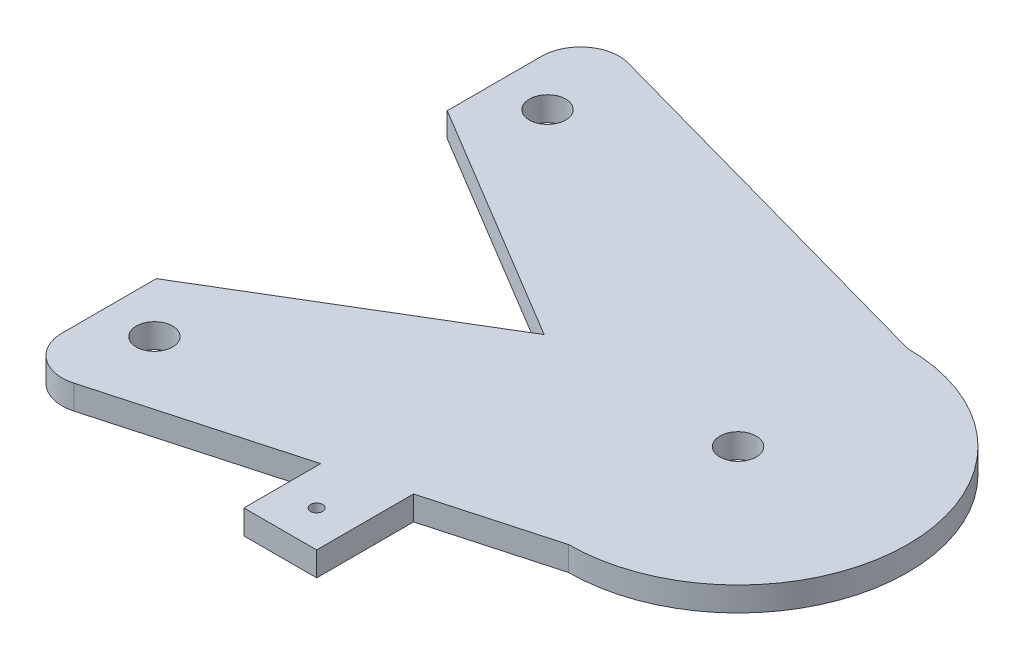
ISO-10303-21;
HEADER;
FILE_DESCRIPTION(('STEP AP214'),'2;1');
FILE_NAME('part.step','',(''),(''),'','','');
FILE_SCHEMA(('AUTOMOTIVE_DESIGN { 1 0 10303 214 1 1 1 1 }'));
ENDSEC;
DATA;
#1=APPLICATION_CONTEXT('core data for automotive mechanical design processes');
#2=APPLICATION_PROTOCOL_DEFINITION('international standard','automotive_design',2000,#1);
#3=PRODUCT_CONTEXT('',#1,'mechanical');
#4=PRODUCT('Part','Part','',(#3));
#5=PRODUCT_RELATED_PRODUCT_CATEGORY('part','',(#4));
#6=PRODUCT_DEFINITION_FORMATION('','',#4);
#7=PRODUCT_DEFINITION_CONTEXT('part definition',#1,'design');
#8=PRODUCT_DEFINITION('design','',#6,#7);
#9=PRODUCT_DEFINITION_SHAPE('','',#8);
#10=(LENGTH_UNIT() NAMED_UNIT(*) SI_UNIT(.MILLI.,.METRE.));
#11=(NAMED_UNIT(*) PLANE_ANGLE_UNIT() SI_UNIT($,.RADIAN.));
#12=(NAMED_UNIT(*) SI_UNIT($,.STERADIAN.) SOLID_ANGLE_UNIT());
#13=UNCERTAINTY_MEASURE_WITH_UNIT(LENGTH_MEASURE(1.E-05),#10,'distance_accuracy_value','');
#14=(GEOMETRIC_REPRESENTATION_CONTEXT(3) GLOBAL_UNCERTAINTY_ASSIGNED_CONTEXT((#13)) GLOBAL_UNIT_ASSIGNED_CONTEXT((#10,
#11,#12)) REPRESENTATION_CONTEXT('',''));
#15=CARTESIAN_POINT('',(0.,0.,0.));
#16=DIRECTION('',(0.,0.,1.));
#17=DIRECTION('',(1.,0.,0.));
#18=AXIS2_PLACEMENT_3D('',#15,#16,#17);
#19=CARTESIAN_POINT('',(50.8,6.35,0.));
#20=DIRECTION('',(0.,-1.,0.));
#21=DIRECTION('',(0.,0.,-1.));
#22=AXIS2_PLACEMENT_3D('',#19,#20,#21);
#23=PLANE('',#22);
#24=CARTESIAN_POINT('',(50.8,6.35,0.));
#25=DIRECTION('',(0.,1.,0.));
#26=DIRECTION('',(0.,0.,-1.));
#27=AXIS2_PLACEMENT_3D('',#24,#25,#26);
#28=CIRCLE('',#27,44.45);
#29=CARTESIAN_POINT('',(50.8,6.35,44.45));
#30=VERTEX_POINT('',#29);
#31=CARTESIAN_POINT('',(50.8,6.35,-44.45));
#32=VERTEX_POINT('',#31);
#33=EDGE_CURVE('E191',#30,#32,#28,.T.);
#34=ORIENTED_EDGE('',*,*,#33,.T.);
#35=DIRECTION('',(-0.96351790962994,0.,-0.267643863786095));
#36=VECTOR('',#35,1.);
#37=CARTESIAN_POINT('',(-50.6207383439333,6.35,-72.6224273177592));
#38=LINE('',#37,#36);
#39=CARTESIAN_POINT('',(-50.6207383439333,6.35,-72.6224273177592));
#40=VERTEX_POINT('',#39);
#41=EDGE_CURVE('E114',#32,#40,#38,.T.);
#42=ORIENTED_EDGE('',*,*,#41,.T.);
#43=CARTESIAN_POINT('',(-53.34,6.35,-62.8330853559191));
#44=DIRECTION('',(0.,1.,0.));
#45=DIRECTION('',(0.,0.,1.));
#46=AXIS2_PLACEMENT_3D('',#43,#44,#45);
#47=CIRCLE('',#46,10.16);
#48=CARTESIAN_POINT('',(-63.5,6.35,-62.8330853559191));
#49=VERTEX_POINT('',#48);
#50=EDGE_CURVE('E221',#40,#49,#47,.T.);
#51=ORIENTED_EDGE('',*,*,#50,.T.);
#52=DIRECTION('',(0.,0.,1.));
#53=VECTOR('',#52,1.);
#54=CARTESIAN_POINT('',(-63.5,6.35,-62.8330853559191));
#55=LINE('',#54,#53);
#56=CARTESIAN_POINT('',(-63.5,6.35,-38.1));
#57=VERTEX_POINT('',#56);
#58=EDGE_CURVE('E240',#49,#57,#55,.T.);
#59=ORIENTED_EDGE('',*,*,#58,.T.);
#60=DIRECTION('',(0.857492925712544,0.,0.514495755427527));
#61=VECTOR('',#60,1.);
#62=CARTESIAN_POINT('',(-63.5,6.35,-38.1));
#63=LINE('',#62,#61);
#64=CARTESIAN_POINT('',(0.,6.35,0.));
#65=VERTEX_POINT('',#64);
#66=EDGE_CURVE('E237',#57,#65,#63,.T.);
#67=ORIENTED_EDGE('',*,*,#66,.T.);
#68=DIRECTION('',(-0.857492925712544,0.,0.514495755427527));
#69=VECTOR('',#68,1.);
#70=CARTESIAN_POINT('',(0.,6.35,0.));
#71=LINE('',#70,#69);
#72=CARTESIAN_POINT('',(-63.5,6.35,38.1));
#73=VERTEX_POINT('',#72);
#74=EDGE_CURVE('E239',#65,#73,#71,.T.);
#75=ORIENTED_EDGE('',*,*,#74,.T.);
#76=DIRECTION('',(0.,0.,1.));
#77=VECTOR('',#76,1.);
#78=CARTESIAN_POINT('',(-63.5,6.35,38.1));
#79=LINE('',#78,#77);
#80=CARTESIAN_POINT('',(-63.5,6.35,62.8330853559191));
#81=VERTEX_POINT('',#80);
#82=EDGE_CURVE('E242',#73,#81,#79,.T.);
#83=ORIENTED_EDGE('',*,*,#82,.T.);
#84=CARTESIAN_POINT('',(-53.34,6.35,62.8330853559191));
#85=DIRECTION('',(0.,1.,0.));
#86=DIRECTION('',(0.,0.,1.));
#87=AXIS2_PLACEMENT_3D('',#84,#85,#86);
#88=CIRCLE('',#87,10.16);
#89=CARTESIAN_POINT('',(-50.6207383439332,6.35,72.6224273177592));
#90=VERTEX_POINT('',#89);
#91=EDGE_CURVE('E248',#81,#90,#88,.T.);
#92=ORIENTED_EDGE('',*,*,#91,.T.);
#93=DIRECTION('',(0.963517909629941,0.,-0.267643863786095));
#94=VECTOR('',#93,1.);
#95=CARTESIAN_POINT('',(-50.6207383439332,6.35,72.6224273177592));
#96=LINE('',#95,#94);
#97=CARTESIAN_POINT('',(0.,6.35,58.5611111111111));
#98=VERTEX_POINT('',#97);
#99=EDGE_CURVE('E250',#90,#98,#96,.T.);
#100=ORIENTED_EDGE('',*,*,#99,.T.);
#101=DIRECTION('',(0.,0.,1.));
#102=VECTOR('',#101,1.);
#103=CARTESIAN_POINT('',(0.,6.35,58.5611111111111));
#104=LINE('',#103,#102);
#105=CARTESIAN_POINT('',(0.,6.35,78.6694444444445));
#106=VERTEX_POINT('',#105);
#107=EDGE_CURVE('E148',#98,#106,#104,.T.);
#108=ORIENTED_EDGE('',*,*,#107,.T.);
#109=DIRECTION('',(1.,0.,0.));
#110=VECTOR('',#109,1.);
#111=CARTESIAN_POINT('',(0.,6.35,78.6694444444445));
#112=LINE('',#111,#110);
#113=CARTESIAN_POINT('',(19.05,6.35,78.6694444444445));
#114=VERTEX_POINT('',#113);
#115=EDGE_CURVE('E142',#106,#114,#112,.T.);
#116=ORIENTED_EDGE('',*,*,#115,.T.);
#117=DIRECTION('',(0.,0.,-1.));
#118=VECTOR('',#117,1.);
#119=CARTESIAN_POINT('',(19.05,6.35,78.6694444444445));
#120=LINE('',#119,#118);
#121=CARTESIAN_POINT('',(19.05,6.35,53.2694444444444));
#122=VERTEX_POINT('',#121);
#123=EDGE_CURVE('E146',#114,#122,#120,.T.);
#124=ORIENTED_EDGE('',*,*,#123,.T.);
#125=DIRECTION('',(0.963517909629941,0.,-0.267643863786095));
#126=VECTOR('',#125,1.);
#127=CARTESIAN_POINT('',(50.8,6.35,44.45));
#128=LINE('',#127,#126);
#129=EDGE_CURVE('E56',#122,#30,#128,.T.);
#130=ORIENTED_EDGE('',*,*,#129,.T.);
#131=EDGE_LOOP('',(#34,#42,#51,#59,#67,#75,#83,#92,#100,#108,#116,#124,#130));
#132=FACE_BOUND('',#131,.T.);
#133=CARTESIAN_POINT('',(50.8,6.35,0.));
#134=DIRECTION('',(0.,1.,0.));
#135=DIRECTION('',(0.,0.,1.));
#136=AXIS2_PLACEMENT_3D('',#133,#134,#135);
#137=CIRCLE('',#136,4.7625);
#138=CARTESIAN_POINT('',(50.8,6.35,4.7625));
#139=VERTEX_POINT('',#138);
#140=EDGE_CURVE('E170',#139,#139,#137,.T.);
#141=ORIENTED_EDGE('',*,*,#140,.F.);
#142=EDGE_LOOP('',(#141));
#143=FACE_BOUND('',#142,.T.);
#144=CARTESIAN_POINT('',(-50.6207383439333,6.35,-51.4974351620596));
#145=DIRECTION('',(0.,1.,0.));
#146=DIRECTION('',(0.,0.,1.));
#147=AXIS2_PLACEMENT_3D('',#144,#145,#146);
#148=CIRCLE('',#147,4.7625);
#149=CARTESIAN_POINT('',(-50.6207383439333,6.35,-46.7349351620596));
#150=VERTEX_POINT('',#149);
#151=EDGE_CURVE('E314',#150,#150,#148,.T.);
#152=ORIENTED_EDGE('',*,*,#151,.F.);
#153=EDGE_LOOP('',(#152));
#154=FACE_BOUND('',#153,.T.);
#155=CARTESIAN_POINT('',(-50.6207383439333,6.35,51.4974351620596));
#156=DIRECTION('',(0.,1.,0.));
#157=DIRECTION('',(0.,0.,1.));
#158=AXIS2_PLACEMENT_3D('',#155,#156,#157);
#159=CIRCLE('',#158,4.7625);
#160=CARTESIAN_POINT('',(-50.6207383439333,6.35,56.2599351620596));
#161=VERTEX_POINT('',#160);
#162=EDGE_CURVE('E308',#161,#161,#159,.T.);
#163=ORIENTED_EDGE('',*,*,#162,.F.);
#164=EDGE_LOOP('',(#163));
#165=FACE_BOUND('',#164,.T.);
#166=CARTESIAN_POINT('',(9.525,6.35,69.1444444444444));
#167=DIRECTION('',(0.,1.,0.));
#168=DIRECTION('',(0.,0.,1.));
#169=AXIS2_PLACEMENT_3D('',#166,#167,#168);
#170=CIRCLE('',#169,1.5875);
#171=CARTESIAN_POINT('',(9.525,6.35,70.7319444444445));
#172=VERTEX_POINT('',#171);
#173=EDGE_CURVE('E299',#172,#172,#170,.T.);
#174=ORIENTED_EDGE('',*,*,#173,.F.);
#175=EDGE_LOOP('',(#174));
#176=FACE_BOUND('',#175,.T.);
#177=ADVANCED_FACE('F39',(#132,#143,#154,#165,#176),#23,.F.);
#178=CARTESIAN_POINT('',(50.8,0.,0.));
#179=DIRECTION('',(0.,-1.,0.));
#180=DIRECTION('',(0.,0.,-1.));
#181=AXIS2_PLACEMENT_3D('',#178,#179,#180);
#182=PLANE('',#181);
#183=CARTESIAN_POINT('',(-50.6207383439333,0.,51.4974351620596));
#184=DIRECTION('',(0.,1.,0.));
#185=DIRECTION('',(0.,0.,1.));
#186=AXIS2_PLACEMENT_3D('',#183,#184,#185);
#187=CIRCLE('',#186,4.7625);
#188=CARTESIAN_POINT('',(-50.6207383439333,0.,56.2599351620596));
#189=VERTEX_POINT('',#188);
#190=EDGE_CURVE('E305',#189,#189,#187,.T.);
#191=ORIENTED_EDGE('',*,*,#190,.T.);
#192=EDGE_LOOP('',(#191));
#193=FACE_BOUND('',#192,.T.);
#194=CARTESIAN_POINT('',(50.8,0.,0.));
#195=DIRECTION('',(0.,1.,0.));
#196=DIRECTION('',(0.,0.,1.));
#197=AXIS2_PLACEMENT_3D('',#194,#195,#196);
#198=CIRCLE('',#197,4.7625);
#199=CARTESIAN_POINT('',(50.8,0.,4.7625));
#200=VERTEX_POINT('',#199);
#201=EDGE_CURVE('E317',#200,#200,#198,.T.);
#202=ORIENTED_EDGE('',*,*,#201,.T.);
#203=EDGE_LOOP('',(#202));
#204=FACE_BOUND('',#203,.T.);
#205=CARTESIAN_POINT('',(50.8,0.,0.));
#206=DIRECTION('',(0.,1.,0.));
#207=DIRECTION('',(0.,0.,-1.));
#208=AXIS2_PLACEMENT_3D('',#205,#206,#207);
#209=CIRCLE('',#208,44.45);
#210=CARTESIAN_POINT('',(50.8,0.,44.45));
#211=VERTEX_POINT('',#210);
#212=CARTESIAN_POINT('',(50.8,0.,-44.45));
#213=VERTEX_POINT('',#212);
#214=EDGE_CURVE('E166',#211,#213,#209,.T.);
#215=ORIENTED_EDGE('',*,*,#214,.F.);
#216=DIRECTION('',(0.963517909629941,0.,-0.267643863786095));
#217=VECTOR('',#216,1.);
#218=CARTESIAN_POINT('',(50.8,0.,44.45));
#219=LINE('',#218,#217);
#220=CARTESIAN_POINT('',(19.05,0.,53.2694444444444));
#221=VERTEX_POINT('',#220);
#222=EDGE_CURVE('E106',#221,#211,#219,.T.);
#223=ORIENTED_EDGE('',*,*,#222,.F.);
#224=DIRECTION('',(0.,0.,-1.));
#225=VECTOR('',#224,1.);
#226=CARTESIAN_POINT('',(19.05,0.,78.6694444444445));
#227=LINE('',#226,#225);
#228=CARTESIAN_POINT('',(19.05,0.,78.6694444444445));
#229=VERTEX_POINT('',#228);
#230=EDGE_CURVE('E100',#229,#221,#227,.T.);
#231=ORIENTED_EDGE('',*,*,#230,.F.);
#232=DIRECTION('',(1.,0.,0.));
#233=VECTOR('',#232,1.);
#234=CARTESIAN_POINT('',(0.,0.,78.6694444444445));
#235=LINE('',#234,#233);
#236=CARTESIAN_POINT('',(0.,0.,78.6694444444445));
#237=VERTEX_POINT('',#236);
#238=EDGE_CURVE('E156',#237,#229,#235,.T.);
#239=ORIENTED_EDGE('',*,*,#238,.F.);
#240=DIRECTION('',(0.,0.,1.));
#241=VECTOR('',#240,1.);
#242=CARTESIAN_POINT('',(0.,0.,58.5611111111111));
#243=LINE('',#242,#241);
#244=CARTESIAN_POINT('',(0.,0.,58.5611111111111));
#245=VERTEX_POINT('',#244);
#246=EDGE_CURVE('E186',#245,#237,#243,.T.);
#247=ORIENTED_EDGE('',*,*,#246,.F.);
#248=DIRECTION('',(0.963517909629941,0.,-0.267643863786095));
#249=VECTOR('',#248,1.);
#250=CARTESIAN_POINT('',(-50.6207383439332,0.,72.6224273177592));
#251=LINE('',#250,#249);
#252=CARTESIAN_POINT('',(-50.6207383439332,0.,72.6224273177592));
#253=VERTEX_POINT('',#252);
#254=EDGE_CURVE('E184',#253,#245,#251,.T.);
#255=ORIENTED_EDGE('',*,*,#254,.F.);
#256=CARTESIAN_POINT('',(-53.34,0.,62.8330853559191));
#257=DIRECTION('',(0.,1.,0.));
#258=DIRECTION('',(0.,0.,1.));
#259=AXIS2_PLACEMENT_3D('',#256,#257,#258);
#260=CIRCLE('',#259,10.16);
#261=CARTESIAN_POINT('',(-63.5,0.,62.8330853559191));
#262=VERTEX_POINT('',#261);
#263=EDGE_CURVE('E182',#262,#253,#260,.T.);
#264=ORIENTED_EDGE('',*,*,#263,.F.);
#265=DIRECTION('',(0.,0.,1.));
#266=VECTOR('',#265,1.);
#267=CARTESIAN_POINT('',(-63.5,0.,38.1));
#268=LINE('',#267,#266);
#269=CARTESIAN_POINT('',(-63.5,0.,38.1));
#270=VERTEX_POINT('',#269);
#271=EDGE_CURVE('E180',#270,#262,#268,.T.);
#272=ORIENTED_EDGE('',*,*,#271,.F.);
#273=DIRECTION('',(-0.857492925712544,0.,0.514495755427527));
#274=VECTOR('',#273,1.);
#275=CARTESIAN_POINT('',(0.,0.,0.));
#276=LINE('',#275,#274);
#277=CARTESIAN_POINT('',(0.,0.,0.));
#278=VERTEX_POINT('',#277);
#279=EDGE_CURVE('E178',#278,#270,#276,.T.);
#280=ORIENTED_EDGE('',*,*,#279,.F.);
#281=DIRECTION('',(0.857492925712544,0.,0.514495755427527));
#282=VECTOR('',#281,1.);
#283=CARTESIAN_POINT('',(-63.5,0.,-38.1));
#284=LINE('',#283,#282);
#285=CARTESIAN_POINT('',(-63.5,0.,-38.1));
#286=VERTEX_POINT('',#285);
#287=EDGE_CURVE('E176',#286,#278,#284,.T.);
#288=ORIENTED_EDGE('',*,*,#287,.F.);
#289=DIRECTION('',(0.,0.,1.));
#290=VECTOR('',#289,1.);
#291=CARTESIAN_POINT('',(-63.5,0.,-62.8330853559191));
#292=LINE('',#291,#290);
#293=CARTESIAN_POINT('',(-63.5,0.,-62.8330853559191));
#294=VERTEX_POINT('',#293);
#295=EDGE_CURVE('E174',#294,#286,#292,.T.);
#296=ORIENTED_EDGE('',*,*,#295,.F.);
#297=CARTESIAN_POINT('',(-53.34,0.,-62.8330853559191));
#298=DIRECTION('',(0.,1.,0.));
#299=DIRECTION('',(0.,0.,1.));
#300=AXIS2_PLACEMENT_3D('',#297,#298,#299);
#301=CIRCLE('',#300,10.16);
#302=CARTESIAN_POINT('',(-50.6207383439333,0.,-72.6224273177592));
#303=VERTEX_POINT('',#302);
#304=EDGE_CURVE('E172',#303,#294,#301,.T.);
#305=ORIENTED_EDGE('',*,*,#304,.F.);
#306=DIRECTION('',(-0.96351790962994,0.,-0.267643863786095));
#307=VECTOR('',#306,1.);
#308=CARTESIAN_POINT('',(-50.6207383439333,0.,-72.6224273177592));
#309=LINE('',#308,#307);
#310=EDGE_CURVE('E169',#213,#303,#309,.T.);
#311=ORIENTED_EDGE('',*,*,#310,.F.);
#312=EDGE_LOOP('',(#215,#223,#231,#239,#247,#255,#264,#272,#280,#288,#296,#305,#311));
#313=FACE_BOUND('',#312,.T.);
#314=CARTESIAN_POINT('',(-50.6207383439333,0.,-51.4974351620596));
#315=DIRECTION('',(0.,1.,0.));
#316=DIRECTION('',(0.,0.,1.));
#317=AXIS2_PLACEMENT_3D('',#314,#315,#316);
#318=CIRCLE('',#317,4.7625);
#319=CARTESIAN_POINT('',(-50.6207383439333,0.,-46.7349351620596));
#320=VERTEX_POINT('',#319);
#321=EDGE_CURVE('E311',#320,#320,#318,.T.);
#322=ORIENTED_EDGE('',*,*,#321,.T.);
#323=EDGE_LOOP('',(#322));
#324=FACE_BOUND('',#323,.T.);
#325=CARTESIAN_POINT('',(9.525,0.,69.1444444444444));
#326=DIRECTION('',(0.,1.,0.));
#327=DIRECTION('',(0.,0.,1.));
#328=AXIS2_PLACEMENT_3D('',#325,#326,#327);
#329=CIRCLE('',#328,1.5875);
#330=CARTESIAN_POINT('',(9.525,0.,70.7319444444445));
#331=VERTEX_POINT('',#330);
#332=EDGE_CURVE('E302',#331,#331,#329,.T.);
#333=ORIENTED_EDGE('',*,*,#332,.T.);
#334=EDGE_LOOP('',(#333));
#335=FACE_BOUND('',#334,.T.);
#336=ADVANCED_FACE('F225',(#193,#204,#313,#324,#335),#182,.T.);
#337=CARTESIAN_POINT('',(50.8,6.35,0.));
#338=DIRECTION('',(0.,-1.,0.));
#339=DIRECTION('',(0.,0.,-1.));
#340=AXIS2_PLACEMENT_3D('',#337,#338,#339);
#341=CYLINDRICAL_SURFACE('',#340,44.45);
#342=ORIENTED_EDGE('',*,*,#214,.T.);
#343=DIRECTION('',(0.,-1.,0.));
#344=VECTOR('',#343,1.);
#345=CARTESIAN_POINT('',(50.8,6.35,-44.45));
#346=LINE('',#345,#344);
#347=EDGE_CURVE('E11',#32,#213,#346,.T.);
#348=ORIENTED_EDGE('',*,*,#347,.F.);
#349=ORIENTED_EDGE('',*,*,#33,.F.);
#350=DIRECTION('',(0.,-1.,0.));
#351=VECTOR('',#350,1.);
#352=CARTESIAN_POINT('',(50.8,6.35,44.45));
#353=LINE('',#352,#351);
#354=EDGE_CURVE('E162',#30,#211,#353,.T.);
#355=ORIENTED_EDGE('',*,*,#354,.T.);
#356=EDGE_LOOP('',(#342,#348,#349,#355));
#357=FACE_BOUND('',#356,.T.);
#358=ADVANCED_FACE('F41',(#357),#341,.T.);
#359=CARTESIAN_POINT('',(-50.6207383439333,6.35,-72.6224273177592));
#360=DIRECTION('',(-0.267643863786095,0.,0.963517909629941));
#361=DIRECTION('',(0.963517909629941,0.,0.267643863786095));
#362=AXIS2_PLACEMENT_3D('',#359,#360,#361);
#363=PLANE('',#362);
#364=ORIENTED_EDGE('',*,*,#310,.T.);
#365=DIRECTION('',(0.,-1.,0.));
#366=VECTOR('',#365,1.);
#367=CARTESIAN_POINT('',(-50.6207383439333,6.35,-72.6224273177592));
#368=LINE('',#367,#366);
#369=EDGE_CURVE('E48',#40,#303,#368,.T.);
#370=ORIENTED_EDGE('',*,*,#369,.F.);
#371=ORIENTED_EDGE('',*,*,#41,.F.);
#372=ORIENTED_EDGE('',*,*,#347,.T.);
#373=EDGE_LOOP('',(#364,#370,#371,#372));
#374=FACE_BOUND('',#373,.T.);
#375=ADVANCED_FACE('F443',(#374),#363,.F.);
#376=CARTESIAN_POINT('',(-53.34,6.35,-62.8330853559191));
#377=DIRECTION('',(0.,-1.,0.));
#378=DIRECTION('',(0.,0.,-1.));
#379=AXIS2_PLACEMENT_3D('',#376,#377,#378);
#380=CYLINDRICAL_SURFACE('',#379,10.16);
#381=ORIENTED_EDGE('',*,*,#304,.T.);
#382=DIRECTION('',(0.,-1.,0.));
#383=VECTOR('',#382,1.);
#384=CARTESIAN_POINT('',(-63.5,6.35,-62.8330853559191));
#385=LINE('',#384,#383);
#386=EDGE_CURVE('E213',#49,#294,#385,.T.);
#387=ORIENTED_EDGE('',*,*,#386,.F.);
#388=ORIENTED_EDGE('',*,*,#50,.F.);
#389=ORIENTED_EDGE('',*,*,#369,.T.);
#390=EDGE_LOOP('',(#381,#387,#388,#389));
#391=FACE_BOUND('',#390,.T.);
#392=ADVANCED_FACE('F219',(#391),#380,.T.);
#393=CARTESIAN_POINT('',(-63.5,6.35,-62.8330853559191));
#394=DIRECTION('',(1.,0.,0.));
#395=DIRECTION('',(0.,0.,-1.));
#396=AXIS2_PLACEMENT_3D('',#393,#394,#395);
#397=PLANE('',#396);
#398=ORIENTED_EDGE('',*,*,#295,.T.);
#399=DIRECTION('',(0.,-1.,0.));
#400=VECTOR('',#399,1.);
#401=CARTESIAN_POINT('',(-63.5,6.35,-38.1));
#402=LINE('',#401,#400);
#403=EDGE_CURVE('E210',#57,#286,#402,.T.);
#404=ORIENTED_EDGE('',*,*,#403,.F.);
#405=ORIENTED_EDGE('',*,*,#58,.F.);
#406=ORIENTED_EDGE('',*,*,#386,.T.);
#407=EDGE_LOOP('',(#398,#404,#405,#406));
#408=FACE_BOUND('',#407,.T.);
#409=ADVANCED_FACE('F231',(#408),#397,.F.);
#410=CARTESIAN_POINT('',(-63.5,6.35,-38.1));
#411=DIRECTION('',(0.514495755427527,0.,-0.857492925712544));
#412=DIRECTION('',(-0.857492925712544,0.,-0.514495755427527));
#413=AXIS2_PLACEMENT_3D('',#410,#411,#412);
#414=PLANE('',#413);
#415=ORIENTED_EDGE('',*,*,#287,.T.);
#416=DIRECTION('',(0.,-1.,0.));
#417=VECTOR('',#416,1.);
#418=CARTESIAN_POINT('',(0.,6.35,0.));
#419=LINE('',#418,#417);
#420=EDGE_CURVE('E207',#65,#278,#419,.T.);
#421=ORIENTED_EDGE('',*,*,#420,.F.);
#422=ORIENTED_EDGE('',*,*,#66,.F.);
#423=ORIENTED_EDGE('',*,*,#403,.T.);
#424=EDGE_LOOP('',(#415,#421,#422,#423));
#425=FACE_BOUND('',#424,.T.);
#426=ADVANCED_FACE('F235',(#425),#414,.F.);
#427=CARTESIAN_POINT('',(0.,6.35,0.));
#428=DIRECTION('',(0.514495755427527,0.,0.857492925712544));
#429=DIRECTION('',(0.857492925712544,0.,-0.514495755427527));
#430=AXIS2_PLACEMENT_3D('',#427,#428,#429);
#431=PLANE('',#430);
#432=ORIENTED_EDGE('',*,*,#279,.T.);
#433=DIRECTION('',(0.,-1.,0.));
#434=VECTOR('',#433,1.);
#435=CARTESIAN_POINT('',(-63.5,6.35,38.1));
#436=LINE('',#435,#434);
#437=EDGE_CURVE('E204',#73,#270,#436,.T.);
#438=ORIENTED_EDGE('',*,*,#437,.F.);
#439=ORIENTED_EDGE('',*,*,#74,.F.);
#440=ORIENTED_EDGE('',*,*,#420,.T.);
#441=EDGE_LOOP('',(#432,#438,#439,#440));
#442=FACE_BOUND('',#441,.T.);
#443=ADVANCED_FACE('F408',(#442),#431,.F.);
#444=CARTESIAN_POINT('',(-63.5,6.35,38.1));
#445=DIRECTION('',(1.,0.,0.));
#446=DIRECTION('',(0.,0.,-1.));
#447=AXIS2_PLACEMENT_3D('',#444,#445,#446);
#448=PLANE('',#447);
#449=ORIENTED_EDGE('',*,*,#271,.T.);
#450=DIRECTION('',(0.,-1.,0.));
#451=VECTOR('',#450,1.);
#452=CARTESIAN_POINT('',(-63.5,6.35,62.8330853559191));
#453=LINE('',#452,#451);
#454=EDGE_CURVE('E201',#81,#262,#453,.T.);
#455=ORIENTED_EDGE('',*,*,#454,.F.);
#456=ORIENTED_EDGE('',*,*,#82,.F.);
#457=ORIENTED_EDGE('',*,*,#437,.T.);
#458=EDGE_LOOP('',(#449,#455,#456,#457));
#459=FACE_BOUND('',#458,.T.);
#460=ADVANCED_FACE('F398',(#459),#448,.F.);
#461=CARTESIAN_POINT('',(-53.34,6.35,62.8330853559191));
#462=DIRECTION('',(0.,-1.,0.));
#463=DIRECTION('',(0.,0.,-1.));
#464=AXIS2_PLACEMENT_3D('',#461,#462,#463);
#465=CYLINDRICAL_SURFACE('',#464,10.16);
#466=ORIENTED_EDGE('',*,*,#263,.T.);
#467=DIRECTION('',(0.,-1.,0.));
#468=VECTOR('',#467,1.);
#469=CARTESIAN_POINT('',(-50.6207383439332,6.35,72.6224273177592));
#470=LINE('',#469,#468);
#471=EDGE_CURVE('E198',#90,#253,#470,.T.);
#472=ORIENTED_EDGE('',*,*,#471,.F.);
#473=ORIENTED_EDGE('',*,*,#91,.F.);
#474=ORIENTED_EDGE('',*,*,#454,.T.);
#475=EDGE_LOOP('',(#466,#472,#473,#474));
#476=FACE_BOUND('',#475,.T.);
#477=ADVANCED_FACE('F389',(#476),#465,.T.);
#478=CARTESIAN_POINT('',(-50.6207383439332,6.35,72.6224273177592));
#479=DIRECTION('',(-0.267643863786095,0.,-0.96351790962994));
#480=DIRECTION('',(-0.963517909629941,0.,0.267643863786095));
#481=AXIS2_PLACEMENT_3D('',#478,#479,#480);
#482=PLANE('',#481);
#483=ORIENTED_EDGE('',*,*,#254,.T.);
#484=DIRECTION('',(0.,-1.,0.));
#485=VECTOR('',#484,1.);
#486=CARTESIAN_POINT('',(0.,6.35,58.5611111111111));
#487=LINE('',#486,#485);
#488=EDGE_CURVE('E195',#98,#245,#487,.T.);
#489=ORIENTED_EDGE('',*,*,#488,.F.);
#490=ORIENTED_EDGE('',*,*,#99,.F.);
#491=ORIENTED_EDGE('',*,*,#471,.T.);
#492=EDGE_LOOP('',(#483,#489,#490,#491));
#493=FACE_BOUND('',#492,.T.);
#494=ADVANCED_FACE('F256',(#493),#482,.F.);
#495=CARTESIAN_POINT('',(0.,6.35,58.5611111111111));
#496=DIRECTION('',(1.,0.,0.));
#497=DIRECTION('',(0.,0.,-1.));
#498=AXIS2_PLACEMENT_3D('',#495,#496,#497);
#499=PLANE('',#498);
#500=ORIENTED_EDGE('',*,*,#246,.T.);
#501=DIRECTION('',(0.,-1.,0.));
#502=VECTOR('',#501,1.);
#503=CARTESIAN_POINT('',(0.,6.35,78.6694444444445));
#504=LINE('',#503,#502);
#505=EDGE_CURVE('E157',#106,#237,#504,.T.);
#506=ORIENTED_EDGE('',*,*,#505,.F.);
#507=ORIENTED_EDGE('',*,*,#107,.F.);
#508=ORIENTED_EDGE('',*,*,#488,.T.);
#509=EDGE_LOOP('',(#500,#506,#507,#508));
#510=FACE_BOUND('',#509,.T.);
#511=ADVANCED_FACE('F260',(#510),#499,.F.);
#512=CARTESIAN_POINT('',(0.,6.35,78.6694444444445));
#513=DIRECTION('',(0.,0.,-1.));
#514=DIRECTION('',(-1.,0.,0.));
#515=AXIS2_PLACEMENT_3D('',#512,#513,#514);
#516=PLANE('',#515);
#517=ORIENTED_EDGE('',*,*,#238,.T.);
#518=DIRECTION('',(0.,-1.,0.));
#519=VECTOR('',#518,1.);
#520=CARTESIAN_POINT('',(19.05,6.35,78.6694444444445));
#521=LINE('',#520,#519);
#522=EDGE_CURVE('E153',#114,#229,#521,.T.);
#523=ORIENTED_EDGE('',*,*,#522,.F.);
#524=ORIENTED_EDGE('',*,*,#115,.F.);
#525=ORIENTED_EDGE('',*,*,#505,.T.);
#526=EDGE_LOOP('',(#517,#523,#524,#525));
#527=FACE_BOUND('',#526,.T.);
#528=ADVANCED_FACE('F154',(#527),#516,.F.);
#529=CARTESIAN_POINT('',(19.05,6.35,78.6694444444445));
#530=DIRECTION('',(-1.,0.,0.));
#531=DIRECTION('',(0.,0.,1.));
#532=AXIS2_PLACEMENT_3D('',#529,#530,#531);
#533=PLANE('',#532);
#534=ORIENTED_EDGE('',*,*,#230,.T.);
#535=DIRECTION('',(0.,-1.,0.));
#536=VECTOR('',#535,1.);
#537=CARTESIAN_POINT('',(19.05,6.35,53.2694444444444));
#538=LINE('',#537,#536);
#539=EDGE_CURVE('E158',#122,#221,#538,.T.);
#540=ORIENTED_EDGE('',*,*,#539,.F.);
#541=ORIENTED_EDGE('',*,*,#123,.F.);
#542=ORIENTED_EDGE('',*,*,#522,.T.);
#543=EDGE_LOOP('',(#534,#540,#541,#542));
#544=FACE_BOUND('',#543,.T.);
#545=ADVANCED_FACE('F160',(#544),#533,.F.);
#546=CARTESIAN_POINT('',(50.8,6.35,44.45));
#547=DIRECTION('',(-0.267643863786095,0.,-0.963517909629941));
#548=DIRECTION('',(-0.963517909629941,0.,0.267643863786095));
#549=AXIS2_PLACEMENT_3D('',#546,#547,#548);
#550=PLANE('',#549);
#551=ORIENTED_EDGE('',*,*,#222,.T.);
#552=ORIENTED_EDGE('',*,*,#354,.F.);
#553=ORIENTED_EDGE('',*,*,#129,.F.);
#554=ORIENTED_EDGE('',*,*,#539,.T.);
#555=EDGE_LOOP('',(#551,#552,#553,#554));
#556=FACE_BOUND('',#555,.T.);
#557=ADVANCED_FACE('F264',(#556),#550,.F.);
#558=CARTESIAN_POINT('',(50.8,6.35,0.));
#559=DIRECTION('',(0.,-1.,0.));
#560=DIRECTION('',(0.,0.,-1.));
#561=AXIS2_PLACEMENT_3D('',#558,#559,#560);
#562=CYLINDRICAL_SURFACE('',#561,4.7625);
#563=ORIENTED_EDGE('',*,*,#140,.T.);
#564=EDGE_LOOP('',(#563));
#565=FACE_BOUND('',#564,.T.);
#566=ORIENTED_EDGE('',*,*,#201,.F.);
#567=EDGE_LOOP('',(#566));
#568=FACE_BOUND('',#567,.T.);
#569=ADVANCED_FACE('F266',(#565,#568),#562,.F.);
#570=CARTESIAN_POINT('',(-50.6207383439333,6.35,-51.4974351620596));
#571=DIRECTION('',(0.,-1.,0.));
#572=DIRECTION('',(0.,0.,-1.));
#573=AXIS2_PLACEMENT_3D('',#570,#571,#572);
#574=CYLINDRICAL_SURFACE('',#573,4.7625);
#575=ORIENTED_EDGE('',*,*,#151,.T.);
#576=EDGE_LOOP('',(#575));
#577=FACE_BOUND('',#576,.T.);
#578=ORIENTED_EDGE('',*,*,#321,.F.);
#579=EDGE_LOOP('',(#578));
#580=FACE_BOUND('',#579,.T.);
#581=ADVANCED_FACE('F272',(#577,#580),#574,.F.);
#582=CARTESIAN_POINT('',(-50.6207383439333,6.35,51.4974351620596));
#583=DIRECTION('',(0.,-1.,0.));
#584=DIRECTION('',(0.,0.,-1.));
#585=AXIS2_PLACEMENT_3D('',#582,#583,#584);
#586=CYLINDRICAL_SURFACE('',#585,4.7625);
#587=ORIENTED_EDGE('',*,*,#162,.T.);
#588=EDGE_LOOP('',(#587));
#589=FACE_BOUND('',#588,.T.);
#590=ORIENTED_EDGE('',*,*,#190,.F.);
#591=EDGE_LOOP('',(#590));
#592=FACE_BOUND('',#591,.T.);
#593=ADVANCED_FACE('F286',(#589,#592),#586,.F.);
#594=CARTESIAN_POINT('',(9.525,6.35,69.1444444444444));
#595=DIRECTION('',(0.,-1.,0.));
#596=DIRECTION('',(0.,0.,-1.));
#597=AXIS2_PLACEMENT_3D('',#594,#595,#596);
#598=CYLINDRICAL_SURFACE('',#597,1.5875);
#599=ORIENTED_EDGE('',*,*,#173,.T.);
#600=EDGE_LOOP('',(#599));
#601=FACE_BOUND('',#600,.T.);
#602=ORIENTED_EDGE('',*,*,#332,.F.);
#603=EDGE_LOOP('',(#602));
#604=FACE_BOUND('',#603,.T.);
#605=ADVANCED_FACE('F290',(#601,#604),#598,.F.);
#606=CLOSED_SHELL('',(#177,#336,#358,#375,#392,#409,#426,#443,#460,#477,#494,#511,#528,#545,
#557,#569,#581,#593,#605));
#607=MANIFOLD_SOLID_BREP('B2',#606);
#608=ADVANCED_BREP_SHAPE_REPRESENTATION('',(#18,#607),#14);
#609=SHAPE_DEFINITION_REPRESENTATION(#9,#608);
ENDSEC;
END-ISO-10303-21;
